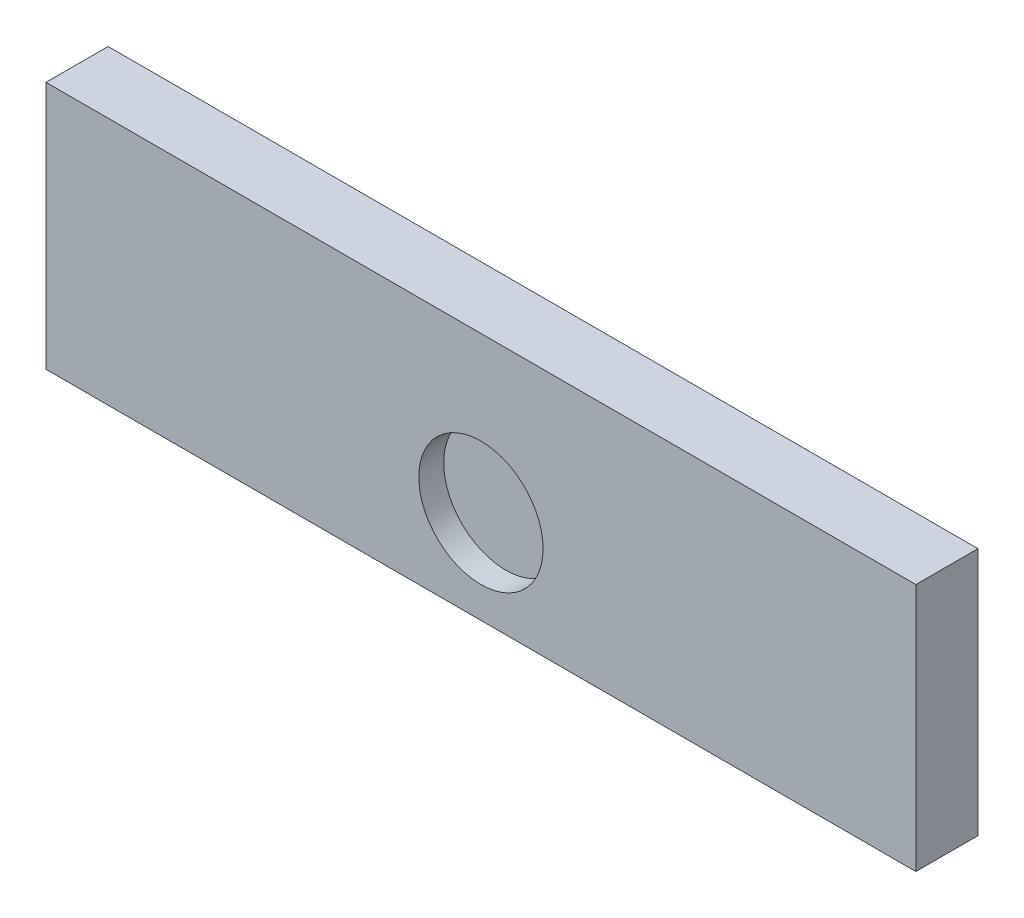
ISO-10303-21;
HEADER;
FILE_DESCRIPTION(('STEP AP214'),'2;1');
FILE_NAME('part.step','',(''),(''),'','','');
FILE_SCHEMA(('AUTOMOTIVE_DESIGN { 1 0 10303 214 1 1 1 1 }'));
ENDSEC;
DATA;
#1=APPLICATION_CONTEXT('core data for automotive mechanical design processes');
#2=APPLICATION_PROTOCOL_DEFINITION('international standard','automotive_design',2000,#1);
#3=PRODUCT_CONTEXT('',#1,'mechanical');
#4=PRODUCT('Part','Part','',(#3));
#5=PRODUCT_RELATED_PRODUCT_CATEGORY('part','',(#4));
#6=PRODUCT_DEFINITION_FORMATION('','',#4);
#7=PRODUCT_DEFINITION_CONTEXT('part definition',#1,'design');
#8=PRODUCT_DEFINITION('design','',#6,#7);
#9=PRODUCT_DEFINITION_SHAPE('','',#8);
#10=(LENGTH_UNIT() NAMED_UNIT(*) SI_UNIT(.MILLI.,.METRE.));
#11=(NAMED_UNIT(*) PLANE_ANGLE_UNIT() SI_UNIT($,.RADIAN.));
#12=(NAMED_UNIT(*) SI_UNIT($,.STERADIAN.) SOLID_ANGLE_UNIT());
#13=UNCERTAINTY_MEASURE_WITH_UNIT(LENGTH_MEASURE(1.E-05),#10,'distance_accuracy_value','');
#14=(GEOMETRIC_REPRESENTATION_CONTEXT(3) GLOBAL_UNCERTAINTY_ASSIGNED_CONTEXT((#13)) GLOBAL_UNIT_ASSIGNED_CONTEXT((#10,
#11,#12)) REPRESENTATION_CONTEXT('',''));
#15=CARTESIAN_POINT('',(0.,0.,0.));
#16=DIRECTION('',(0.,0.,1.));
#17=DIRECTION('',(1.,0.,0.));
#18=AXIS2_PLACEMENT_3D('',#15,#16,#17);
#19=CARTESIAN_POINT('',(70.,20.,10.));
#20=DIRECTION('',(-1.,0.,0.));
#21=DIRECTION('',(0.,0.,1.));
#22=AXIS2_PLACEMENT_3D('',#19,#20,#21);
#23=PLANE('',#22);
#24=DIRECTION('',(0.,1.,0.));
#25=VECTOR('',#24,1.);
#26=CARTESIAN_POINT('',(70.,20.,0.));
#27=LINE('',#26,#25);
#28=CARTESIAN_POINT('',(70.,-20.,0.));
#29=VERTEX_POINT('',#28);
#30=CARTESIAN_POINT('',(70.,20.,0.));
#31=VERTEX_POINT('',#30);
#32=EDGE_CURVE('E111',#29,#31,#27,.T.);
#33=ORIENTED_EDGE('',*,*,#32,.T.);
#34=DIRECTION('',(0.,0.,-1.));
#35=VECTOR('',#34,1.);
#36=CARTESIAN_POINT('',(70.,20.,10.));
#37=LINE('',#36,#35);
#38=CARTESIAN_POINT('',(70.,20.,10.));
#39=VERTEX_POINT('',#38);
#40=EDGE_CURVE('E11',#39,#31,#37,.T.);
#41=ORIENTED_EDGE('',*,*,#40,.F.);
#42=DIRECTION('',(0.,1.,0.));
#43=VECTOR('',#42,1.);
#44=CARTESIAN_POINT('',(70.,20.,10.));
#45=LINE('',#44,#43);
#46=CARTESIAN_POINT('',(70.,-20.,10.));
#47=VERTEX_POINT('',#46);
#48=EDGE_CURVE('E95',#47,#39,#45,.T.);
#49=ORIENTED_EDGE('',*,*,#48,.F.);
#50=DIRECTION('',(0.,0.,-1.));
#51=VECTOR('',#50,1.);
#52=CARTESIAN_POINT('',(70.,-20.,10.));
#53=LINE('',#52,#51);
#54=EDGE_CURVE('E107',#47,#29,#53,.T.);
#55=ORIENTED_EDGE('',*,*,#54,.T.);
#56=EDGE_LOOP('',(#33,#41,#49,#55));
#57=FACE_BOUND('',#56,.T.);
#58=ADVANCED_FACE('F43',(#57),#23,.F.);
#59=CARTESIAN_POINT('',(-70.,20.,10.));
#60=DIRECTION('',(0.,-1.,0.));
#61=DIRECTION('',(0.,0.,-1.));
#62=AXIS2_PLACEMENT_3D('',#59,#60,#61);
#63=PLANE('',#62);
#64=DIRECTION('',(-1.,0.,0.));
#65=VECTOR('',#64,1.);
#66=CARTESIAN_POINT('',(-70.,20.,0.));
#67=LINE('',#66,#65);
#68=CARTESIAN_POINT('',(-70.,20.,0.));
#69=VERTEX_POINT('',#68);
#70=EDGE_CURVE('E100',#31,#69,#67,.T.);
#71=ORIENTED_EDGE('',*,*,#70,.T.);
#72=DIRECTION('',(0.,0.,-1.));
#73=VECTOR('',#72,1.);
#74=CARTESIAN_POINT('',(-70.,20.,10.));
#75=LINE('',#74,#73);
#76=CARTESIAN_POINT('',(-70.,20.,10.));
#77=VERTEX_POINT('',#76);
#78=EDGE_CURVE('E52',#77,#69,#75,.T.);
#79=ORIENTED_EDGE('',*,*,#78,.F.);
#80=DIRECTION('',(-1.,0.,0.));
#81=VECTOR('',#80,1.);
#82=CARTESIAN_POINT('',(-70.,20.,10.));
#83=LINE('',#82,#81);
#84=EDGE_CURVE('E90',#39,#77,#83,.T.);
#85=ORIENTED_EDGE('',*,*,#84,.F.);
#86=ORIENTED_EDGE('',*,*,#40,.T.);
#87=EDGE_LOOP('',(#71,#79,#85,#86));
#88=FACE_BOUND('',#87,.T.);
#89=ADVANCED_FACE('F99',(#88),#63,.F.);
#90=CARTESIAN_POINT('',(-70.,20.,10.));
#91=DIRECTION('',(1.,0.,0.));
#92=DIRECTION('',(0.,0.,-1.));
#93=AXIS2_PLACEMENT_3D('',#90,#91,#92);
#94=PLANE('',#93);
#95=DIRECTION('',(0.,-1.,0.));
#96=VECTOR('',#95,1.);
#97=CARTESIAN_POINT('',(-70.,20.,0.));
#98=LINE('',#97,#96);
#99=CARTESIAN_POINT('',(-70.,-20.,0.));
#100=VERTEX_POINT('',#99);
#101=EDGE_CURVE('E77',#69,#100,#98,.T.);
#102=ORIENTED_EDGE('',*,*,#101,.T.);
#103=DIRECTION('',(0.,0.,-1.));
#104=VECTOR('',#103,1.);
#105=CARTESIAN_POINT('',(-70.,-20.,10.));
#106=LINE('',#105,#104);
#107=CARTESIAN_POINT('',(-70.,-20.,10.));
#108=VERTEX_POINT('',#107);
#109=EDGE_CURVE('E102',#108,#100,#106,.T.);
#110=ORIENTED_EDGE('',*,*,#109,.F.);
#111=DIRECTION('',(0.,-1.,0.));
#112=VECTOR('',#111,1.);
#113=CARTESIAN_POINT('',(-70.,20.,10.));
#114=LINE('',#113,#112);
#115=EDGE_CURVE('E93',#77,#108,#114,.T.);
#116=ORIENTED_EDGE('',*,*,#115,.F.);
#117=ORIENTED_EDGE('',*,*,#78,.T.);
#118=EDGE_LOOP('',(#102,#110,#116,#117));
#119=FACE_BOUND('',#118,.T.);
#120=ADVANCED_FACE('F103',(#119),#94,.F.);
#121=CARTESIAN_POINT('',(-70.,-20.,10.));
#122=DIRECTION('',(0.,1.,0.));
#123=DIRECTION('',(0.,0.,1.));
#124=AXIS2_PLACEMENT_3D('',#121,#122,#123);
#125=PLANE('',#124);
#126=DIRECTION('',(1.,0.,0.));
#127=VECTOR('',#126,1.);
#128=CARTESIAN_POINT('',(-70.,-20.,0.));
#129=LINE('',#128,#127);
#130=EDGE_CURVE('E83',#100,#29,#129,.T.);
#131=ORIENTED_EDGE('',*,*,#130,.T.);
#132=ORIENTED_EDGE('',*,*,#54,.F.);
#133=DIRECTION('',(1.,0.,0.));
#134=VECTOR('',#133,1.);
#135=CARTESIAN_POINT('',(-70.,-20.,10.));
#136=LINE('',#135,#134);
#137=EDGE_CURVE('E60',#108,#47,#136,.T.);
#138=ORIENTED_EDGE('',*,*,#137,.F.);
#139=ORIENTED_EDGE('',*,*,#109,.T.);
#140=EDGE_LOOP('',(#131,#132,#138,#139));
#141=FACE_BOUND('',#140,.T.);
#142=ADVANCED_FACE('F125',(#141),#125,.F.);
#143=CARTESIAN_POINT('',(0.,0.,10.));
#144=DIRECTION('',(0.,0.,1.));
#145=DIRECTION('',(1.,0.,0.));
#146=AXIS2_PLACEMENT_3D('',#143,#144,#145);
#147=PLANE('',#146);
#148=CARTESIAN_POINT('',(0.,-5.,10.));
#149=DIRECTION('',(0.,0.,1.));
#150=DIRECTION('',(1.,0.,0.));
#151=AXIS2_PLACEMENT_3D('',#148,#149,#150);
#152=CIRCLE('',#151,10.);
#153=CARTESIAN_POINT('',(10.,-5.,10.));
#154=VERTEX_POINT('',#153);
#155=EDGE_CURVE('E132',#154,#154,#152,.T.);
#156=ORIENTED_EDGE('',*,*,#155,.F.);
#157=EDGE_LOOP('',(#156));
#158=FACE_BOUND('',#157,.T.);
#159=ORIENTED_EDGE('',*,*,#48,.T.);
#160=ORIENTED_EDGE('',*,*,#84,.T.);
#161=ORIENTED_EDGE('',*,*,#115,.T.);
#162=ORIENTED_EDGE('',*,*,#137,.T.);
#163=EDGE_LOOP('',(#159,#160,#161,#162));
#164=FACE_BOUND('',#163,.T.);
#165=ADVANCED_FACE('F91',(#158,#164),#147,.T.);
#166=CARTESIAN_POINT('',(0.,0.,0.));
#167=DIRECTION('',(0.,0.,1.));
#168=DIRECTION('',(1.,0.,0.));
#169=AXIS2_PLACEMENT_3D('',#166,#167,#168);
#170=PLANE('',#169);
#171=ORIENTED_EDGE('',*,*,#32,.F.);
#172=ORIENTED_EDGE('',*,*,#130,.F.);
#173=ORIENTED_EDGE('',*,*,#101,.F.);
#174=ORIENTED_EDGE('',*,*,#70,.F.);
#175=EDGE_LOOP('',(#171,#172,#173,#174));
#176=FACE_BOUND('',#175,.T.);
#177=ADVANCED_FACE('F128',(#176),#170,.F.);
#178=CARTESIAN_POINT('',(0.,-5.,6.));
#179=DIRECTION('',(0.,0.,1.));
#180=DIRECTION('',(1.,0.,0.));
#181=AXIS2_PLACEMENT_3D('',#178,#179,#180);
#182=CYLINDRICAL_SURFACE('',#181,10.);
#183=CARTESIAN_POINT('',(0.,-5.,6.));
#184=DIRECTION('',(0.,0.,1.));
#185=DIRECTION('',(1.,0.,0.));
#186=AXIS2_PLACEMENT_3D('',#183,#184,#185);
#187=CIRCLE('',#186,10.);
#188=CARTESIAN_POINT('',(10.,-5.,6.));
#189=VERTEX_POINT('',#188);
#190=EDGE_CURVE('E115',#189,#189,#187,.T.);
#191=ORIENTED_EDGE('',*,*,#190,.F.);
#192=EDGE_LOOP('',(#191));
#193=FACE_BOUND('',#192,.T.);
#194=ORIENTED_EDGE('',*,*,#155,.T.);
#195=EDGE_LOOP('',(#194));
#196=FACE_BOUND('',#195,.T.);
#197=ADVANCED_FACE('F142',(#193,#196),#182,.F.);
#198=CARTESIAN_POINT('',(0.,-5.,6.));
#199=DIRECTION('',(0.,0.,1.));
#200=DIRECTION('',(1.,0.,0.));
#201=AXIS2_PLACEMENT_3D('',#198,#199,#200);
#202=PLANE('',#201);
#203=ORIENTED_EDGE('',*,*,#190,.T.);
#204=EDGE_LOOP('',(#203));
#205=FACE_BOUND('',#204,.T.);
#206=ADVANCED_FACE('F140',(#205),#202,.T.);
#207=CLOSED_SHELL('',(#58,#89,#120,#142,#165,#177,#197,#206));
#208=MANIFOLD_SOLID_BREP('B2',#207);
#209=ADVANCED_BREP_SHAPE_REPRESENTATION('',(#18,#208),#14);
#210=SHAPE_DEFINITION_REPRESENTATION(#9,#209);
ENDSEC;
END-ISO-10303-21;
